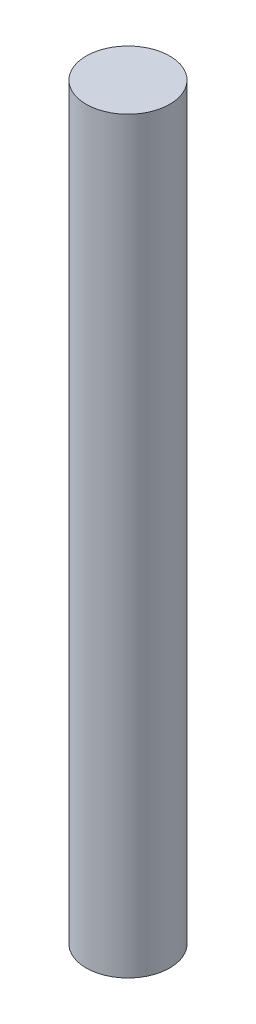
ISO-10303-21;
HEADER;
FILE_DESCRIPTION(('STEP AP214'),'2;1');
FILE_NAME('part.step','',(''),(''),'','','');
FILE_SCHEMA(('AUTOMOTIVE_DESIGN { 1 0 10303 214 1 1 1 1 }'));
ENDSEC;
DATA;
#1=APPLICATION_CONTEXT('core data for automotive mechanical design processes');
#2=APPLICATION_PROTOCOL_DEFINITION('international standard','automotive_design',2000,#1);
#3=PRODUCT_CONTEXT('',#1,'mechanical');
#4=PRODUCT('Part','Part','',(#3));
#5=PRODUCT_RELATED_PRODUCT_CATEGORY('part','',(#4));
#6=PRODUCT_DEFINITION_FORMATION('','',#4);
#7=PRODUCT_DEFINITION_CONTEXT('part definition',#1,'design');
#8=PRODUCT_DEFINITION('design','',#6,#7);
#9=PRODUCT_DEFINITION_SHAPE('','',#8);
#10=(LENGTH_UNIT() NAMED_UNIT(*) SI_UNIT(.MILLI.,.METRE.));
#11=(NAMED_UNIT(*) PLANE_ANGLE_UNIT() SI_UNIT($,.RADIAN.));
#12=(NAMED_UNIT(*) SI_UNIT($,.STERADIAN.) SOLID_ANGLE_UNIT());
#13=UNCERTAINTY_MEASURE_WITH_UNIT(LENGTH_MEASURE(1.E-05),#10,'distance_accuracy_value','');
#14=(GEOMETRIC_REPRESENTATION_CONTEXT(3) GLOBAL_UNCERTAINTY_ASSIGNED_CONTEXT((#13)) GLOBAL_UNIT_ASSIGNED_CONTEXT((#10,
#11,#12)) REPRESENTATION_CONTEXT('',''));
#15=CARTESIAN_POINT('',(0.,0.,0.));
#16=DIRECTION('',(0.,0.,1.));
#17=DIRECTION('',(1.,0.,0.));
#18=AXIS2_PLACEMENT_3D('',#15,#16,#17);
#19=CARTESIAN_POINT('',(0.,100.,0.));
#20=DIRECTION('',(0.,-1.,0.));
#21=DIRECTION('',(0.,0.,-1.));
#22=AXIS2_PLACEMENT_3D('',#19,#20,#21);
#23=CYLINDRICAL_SURFACE('',#22,5.588);
#24=CARTESIAN_POINT('',(0.,100.,0.));
#25=DIRECTION('',(0.,1.,0.));
#26=DIRECTION('',(0.,0.,1.));
#27=AXIS2_PLACEMENT_3D('',#24,#25,#26);
#28=CIRCLE('',#27,5.588);
#29=CARTESIAN_POINT('',(0.,100.,5.588));
#30=VERTEX_POINT('',#29);
#31=EDGE_CURVE('E10',#30,#30,#28,.T.);
#32=ORIENTED_EDGE('',*,*,#31,.F.);
#33=EDGE_LOOP('',(#32));
#34=FACE_BOUND('',#33,.T.);
#35=CARTESIAN_POINT('',(0.,0.,0.));
#36=DIRECTION('',(0.,1.,0.));
#37=DIRECTION('',(0.,0.,1.));
#38=AXIS2_PLACEMENT_3D('',#35,#36,#37);
#39=CIRCLE('',#38,5.588);
#40=CARTESIAN_POINT('',(0.,0.,5.588));
#41=VERTEX_POINT('',#40);
#42=EDGE_CURVE('E46',#41,#41,#39,.T.);
#43=ORIENTED_EDGE('',*,*,#42,.T.);
#44=EDGE_LOOP('',(#43));
#45=FACE_BOUND('',#44,.T.);
#46=ADVANCED_FACE('F43',(#34,#45),#23,.T.);
#47=CARTESIAN_POINT('',(0.,100.,0.));
#48=DIRECTION('',(0.,1.,0.));
#49=DIRECTION('',(0.,0.,1.));
#50=AXIS2_PLACEMENT_3D('',#47,#48,#49);
#51=PLANE('',#50);
#52=ORIENTED_EDGE('',*,*,#31,.T.);
#53=EDGE_LOOP('',(#52));
#54=FACE_BOUND('',#53,.T.);
#55=ADVANCED_FACE('F60',(#54),#51,.T.);
#56=CARTESIAN_POINT('',(0.,0.,0.));
#57=DIRECTION('',(0.,1.,0.));
#58=DIRECTION('',(0.,0.,1.));
#59=AXIS2_PLACEMENT_3D('',#56,#57,#58);
#60=PLANE('',#59);
#61=ORIENTED_EDGE('',*,*,#42,.F.);
#62=EDGE_LOOP('',(#61));
#63=FACE_BOUND('',#62,.T.);
#64=ADVANCED_FACE('F58',(#63),#60,.F.);
#65=CLOSED_SHELL('',(#46,#55,#64));
#66=MANIFOLD_SOLID_BREP('B2',#65);
#67=ADVANCED_BREP_SHAPE_REPRESENTATION('',(#18,#66),#14);
#68=SHAPE_DEFINITION_REPRESENTATION(#9,#67);
ENDSEC;
END-ISO-10303-21;
